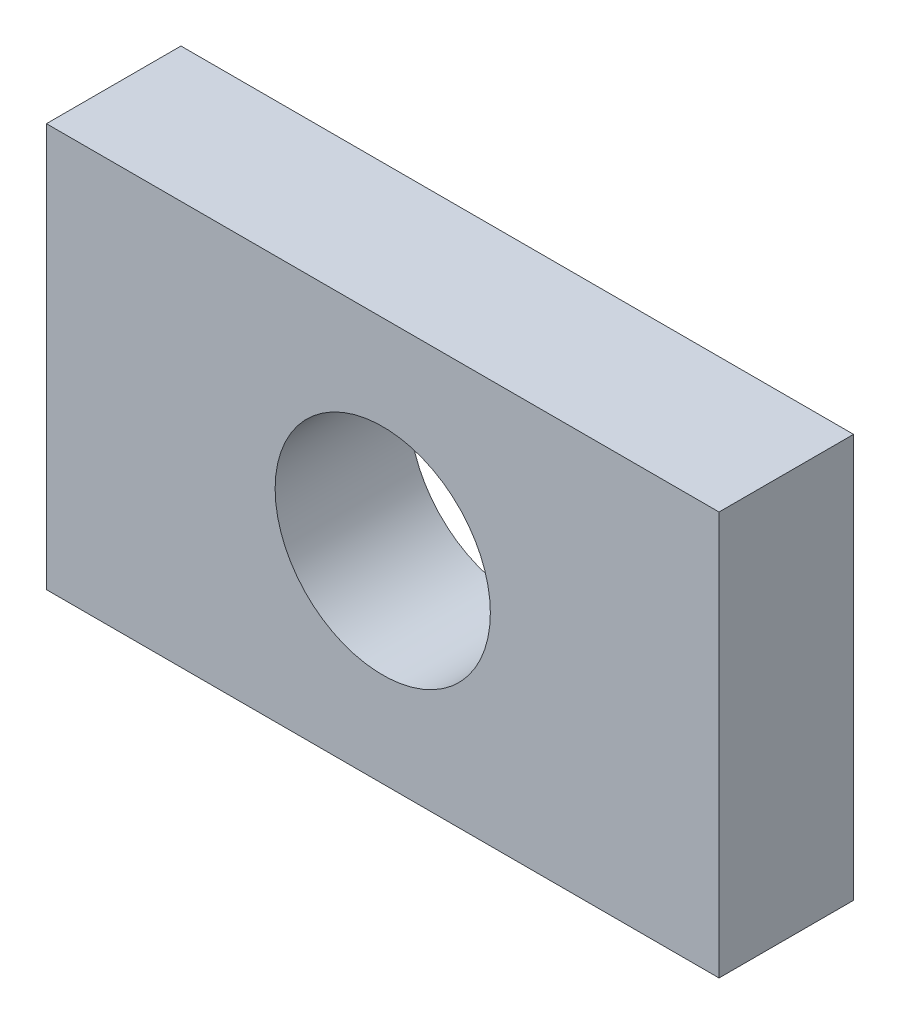
ISO-10303-21;
HEADER;
FILE_DESCRIPTION(('STEP AP214'),'2;1');
FILE_NAME('part.step','',(''),(''),'','','');
FILE_SCHEMA(('AUTOMOTIVE_DESIGN { 1 0 10303 214 1 1 1 1 }'));
ENDSEC;
DATA;
#1=APPLICATION_CONTEXT('core data for automotive mechanical design processes');
#2=APPLICATION_PROTOCOL_DEFINITION('international standard','automotive_design',2000,#1);
#3=PRODUCT_CONTEXT('',#1,'mechanical');
#4=PRODUCT('Part','Part','',(#3));
#5=PRODUCT_RELATED_PRODUCT_CATEGORY('part','',(#4));
#6=PRODUCT_DEFINITION_FORMATION('','',#4);
#7=PRODUCT_DEFINITION_CONTEXT('part definition',#1,'design');
#8=PRODUCT_DEFINITION('design','',#6,#7);
#9=PRODUCT_DEFINITION_SHAPE('','',#8);
#10=(LENGTH_UNIT() NAMED_UNIT(*) SI_UNIT(.MILLI.,.METRE.));
#11=(NAMED_UNIT(*) PLANE_ANGLE_UNIT() SI_UNIT($,.RADIAN.));
#12=(NAMED_UNIT(*) SI_UNIT($,.STERADIAN.) SOLID_ANGLE_UNIT());
#13=UNCERTAINTY_MEASURE_WITH_UNIT(LENGTH_MEASURE(1.E-05),#10,'distance_accuracy_value','');
#14=(GEOMETRIC_REPRESENTATION_CONTEXT(3) GLOBAL_UNCERTAINTY_ASSIGNED_CONTEXT((#13)) GLOBAL_UNIT_ASSIGNED_CONTEXT((#10,
#11,#12)) REPRESENTATION_CONTEXT('',''));
#15=CARTESIAN_POINT('',(0.,0.,0.));
#16=DIRECTION('',(0.,0.,1.));
#17=DIRECTION('',(1.,0.,0.));
#18=AXIS2_PLACEMENT_3D('',#15,#16,#17);
#19=CARTESIAN_POINT('',(0.,0.,2.));
#20=DIRECTION('',(0.,0.,-1.));
#21=DIRECTION('',(-1.,0.,0.));
#22=AXIS2_PLACEMENT_3D('',#19,#20,#21);
#23=PLANE('',#22);
#24=DIRECTION('',(0.,1.,0.));
#25=VECTOR('',#24,1.);
#26=CARTESIAN_POINT('',(10.,0.,2.));
#27=LINE('',#26,#25);
#28=CARTESIAN_POINT('',(10.,0.,2.));
#29=VERTEX_POINT('',#28);
#30=CARTESIAN_POINT('',(10.,6.,2.));
#31=VERTEX_POINT('',#30);
#32=EDGE_CURVE('E84',#29,#31,#27,.T.);
#33=ORIENTED_EDGE('',*,*,#32,.T.);
#34=DIRECTION('',(-1.,0.,0.));
#35=VECTOR('',#34,1.);
#36=CARTESIAN_POINT('',(0.,6.,2.));
#37=LINE('',#36,#35);
#38=CARTESIAN_POINT('',(0.,6.,2.));
#39=VERTEX_POINT('',#38);
#40=EDGE_CURVE('E79',#31,#39,#37,.T.);
#41=ORIENTED_EDGE('',*,*,#40,.T.);
#42=DIRECTION('',(0.,-1.,0.));
#43=VECTOR('',#42,1.);
#44=CARTESIAN_POINT('',(0.,0.,2.));
#45=LINE('',#44,#43);
#46=CARTESIAN_POINT('',(0.,0.,2.));
#47=VERTEX_POINT('',#46);
#48=EDGE_CURVE('E82',#39,#47,#45,.T.);
#49=ORIENTED_EDGE('',*,*,#48,.T.);
#50=DIRECTION('',(1.,0.,0.));
#51=VECTOR('',#50,1.);
#52=CARTESIAN_POINT('',(0.,0.,2.));
#53=LINE('',#52,#51);
#54=EDGE_CURVE('E49',#47,#29,#53,.T.);
#55=ORIENTED_EDGE('',*,*,#54,.T.);
#56=EDGE_LOOP('',(#33,#41,#49,#55));
#57=FACE_BOUND('',#56,.T.);
#58=CARTESIAN_POINT('',(5.,3.,2.));
#59=DIRECTION('',(0.,0.,1.));
#60=DIRECTION('',(1.,0.,0.));
#61=AXIS2_PLACEMENT_3D('',#58,#59,#60);
#62=CIRCLE('',#61,1.6);
#63=CARTESIAN_POINT('',(6.6,3.,2.));
#64=VERTEX_POINT('',#63);
#65=EDGE_CURVE('E99',#64,#64,#62,.T.);
#66=ORIENTED_EDGE('',*,*,#65,.F.);
#67=EDGE_LOOP('',(#66));
#68=FACE_BOUND('',#67,.T.);
#69=ADVANCED_FACE('F32',(#57,#68),#23,.F.);
#70=CARTESIAN_POINT('',(0.,0.,0.));
#71=DIRECTION('',(0.,0.,-1.));
#72=DIRECTION('',(-1.,0.,0.));
#73=AXIS2_PLACEMENT_3D('',#70,#71,#72);
#74=PLANE('',#73);
#75=DIRECTION('',(0.,1.,0.));
#76=VECTOR('',#75,1.);
#77=CARTESIAN_POINT('',(10.,0.,0.));
#78=LINE('',#77,#76);
#79=CARTESIAN_POINT('',(10.,0.,0.));
#80=VERTEX_POINT('',#79);
#81=CARTESIAN_POINT('',(10.,6.,0.));
#82=VERTEX_POINT('',#81);
#83=EDGE_CURVE('E96',#80,#82,#78,.T.);
#84=ORIENTED_EDGE('',*,*,#83,.F.);
#85=DIRECTION('',(1.,0.,0.));
#86=VECTOR('',#85,1.);
#87=CARTESIAN_POINT('',(0.,0.,0.));
#88=LINE('',#87,#86);
#89=CARTESIAN_POINT('',(0.,0.,0.));
#90=VERTEX_POINT('',#89);
#91=EDGE_CURVE('E72',#90,#80,#88,.T.);
#92=ORIENTED_EDGE('',*,*,#91,.F.);
#93=DIRECTION('',(0.,-1.,0.));
#94=VECTOR('',#93,1.);
#95=CARTESIAN_POINT('',(0.,0.,0.));
#96=LINE('',#95,#94);
#97=CARTESIAN_POINT('',(0.,6.,0.));
#98=VERTEX_POINT('',#97);
#99=EDGE_CURVE('E66',#98,#90,#96,.T.);
#100=ORIENTED_EDGE('',*,*,#99,.F.);
#101=DIRECTION('',(-1.,0.,0.));
#102=VECTOR('',#101,1.);
#103=CARTESIAN_POINT('',(0.,6.,0.));
#104=LINE('',#103,#102);
#105=EDGE_CURVE('E88',#82,#98,#104,.T.);
#106=ORIENTED_EDGE('',*,*,#105,.F.);
#107=EDGE_LOOP('',(#84,#92,#100,#106));
#108=FACE_BOUND('',#107,.T.);
#109=CARTESIAN_POINT('',(5.,3.,0.));
#110=DIRECTION('',(0.,0.,1.));
#111=DIRECTION('',(1.,0.,0.));
#112=AXIS2_PLACEMENT_3D('',#109,#110,#111);
#113=CIRCLE('',#112,1.6);
#114=CARTESIAN_POINT('',(6.6,3.,0.));
#115=VERTEX_POINT('',#114);
#116=EDGE_CURVE('E111',#115,#115,#113,.T.);
#117=ORIENTED_EDGE('',*,*,#116,.T.);
#118=EDGE_LOOP('',(#117));
#119=FACE_BOUND('',#118,.T.);
#120=ADVANCED_FACE('F107',(#108,#119),#74,.T.);
#121=CARTESIAN_POINT('',(10.,0.,2.));
#122=DIRECTION('',(-1.,0.,0.));
#123=DIRECTION('',(0.,0.,1.));
#124=AXIS2_PLACEMENT_3D('',#121,#122,#123);
#125=PLANE('',#124);
#126=ORIENTED_EDGE('',*,*,#83,.T.);
#127=DIRECTION('',(0.,0.,-1.));
#128=VECTOR('',#127,1.);
#129=CARTESIAN_POINT('',(10.,6.,2.));
#130=LINE('',#129,#128);
#131=EDGE_CURVE('E11',#31,#82,#130,.T.);
#132=ORIENTED_EDGE('',*,*,#131,.F.);
#133=ORIENTED_EDGE('',*,*,#32,.F.);
#134=DIRECTION('',(0.,0.,-1.));
#135=VECTOR('',#134,1.);
#136=CARTESIAN_POINT('',(10.,0.,2.));
#137=LINE('',#136,#135);
#138=EDGE_CURVE('E92',#29,#80,#137,.T.);
#139=ORIENTED_EDGE('',*,*,#138,.T.);
#140=EDGE_LOOP('',(#126,#132,#133,#139));
#141=FACE_BOUND('',#140,.T.);
#142=ADVANCED_FACE('F34',(#141),#125,.F.);
#143=CARTESIAN_POINT('',(0.,6.,2.));
#144=DIRECTION('',(0.,-1.,0.));
#145=DIRECTION('',(0.,0.,-1.));
#146=AXIS2_PLACEMENT_3D('',#143,#144,#145);
#147=PLANE('',#146);
#148=ORIENTED_EDGE('',*,*,#105,.T.);
#149=DIRECTION('',(0.,0.,-1.));
#150=VECTOR('',#149,1.);
#151=CARTESIAN_POINT('',(0.,6.,2.));
#152=LINE('',#151,#150);
#153=EDGE_CURVE('E41',#39,#98,#152,.T.);
#154=ORIENTED_EDGE('',*,*,#153,.F.);
#155=ORIENTED_EDGE('',*,*,#40,.F.);
#156=ORIENTED_EDGE('',*,*,#131,.T.);
#157=EDGE_LOOP('',(#148,#154,#155,#156));
#158=FACE_BOUND('',#157,.T.);
#159=ADVANCED_FACE('F87',(#158),#147,.F.);
#160=CARTESIAN_POINT('',(0.,0.,2.));
#161=DIRECTION('',(1.,0.,0.));
#162=DIRECTION('',(0.,0.,-1.));
#163=AXIS2_PLACEMENT_3D('',#160,#161,#162);
#164=PLANE('',#163);
#165=ORIENTED_EDGE('',*,*,#99,.T.);
#166=DIRECTION('',(0.,0.,-1.));
#167=VECTOR('',#166,1.);
#168=CARTESIAN_POINT('',(0.,0.,2.));
#169=LINE('',#168,#167);
#170=EDGE_CURVE('E89',#47,#90,#169,.T.);
#171=ORIENTED_EDGE('',*,*,#170,.F.);
#172=ORIENTED_EDGE('',*,*,#48,.F.);
#173=ORIENTED_EDGE('',*,*,#153,.T.);
#174=EDGE_LOOP('',(#165,#171,#172,#173));
#175=FACE_BOUND('',#174,.T.);
#176=ADVANCED_FACE('F90',(#175),#164,.F.);
#177=CARTESIAN_POINT('',(0.,0.,2.));
#178=DIRECTION('',(0.,1.,0.));
#179=DIRECTION('',(0.,0.,1.));
#180=AXIS2_PLACEMENT_3D('',#177,#178,#179);
#181=PLANE('',#180);
#182=ORIENTED_EDGE('',*,*,#91,.T.);
#183=ORIENTED_EDGE('',*,*,#138,.F.);
#184=ORIENTED_EDGE('',*,*,#54,.F.);
#185=ORIENTED_EDGE('',*,*,#170,.T.);
#186=EDGE_LOOP('',(#182,#183,#184,#185));
#187=FACE_BOUND('',#186,.T.);
#188=ADVANCED_FACE('F104',(#187),#181,.F.);
#189=CARTESIAN_POINT('',(5.,3.,2.));
#190=DIRECTION('',(0.,0.,-1.));
#191=DIRECTION('',(-1.,0.,0.));
#192=AXIS2_PLACEMENT_3D('',#189,#190,#191);
#193=CYLINDRICAL_SURFACE('',#192,1.6);
#194=ORIENTED_EDGE('',*,*,#65,.T.);
#195=EDGE_LOOP('',(#194));
#196=FACE_BOUND('',#195,.T.);
#197=ORIENTED_EDGE('',*,*,#116,.F.);
#198=EDGE_LOOP('',(#197));
#199=FACE_BOUND('',#198,.T.);
#200=ADVANCED_FACE('F117',(#196,#199),#193,.F.);
#201=CLOSED_SHELL('',(#69,#120,#142,#159,#176,#188,#200));
#202=MANIFOLD_SOLID_BREP('B2',#201);
#203=ADVANCED_BREP_SHAPE_REPRESENTATION('',(#18,#202),#14);
#204=SHAPE_DEFINITION_REPRESENTATION(#9,#203);
ENDSEC;
END-ISO-10303-21;
